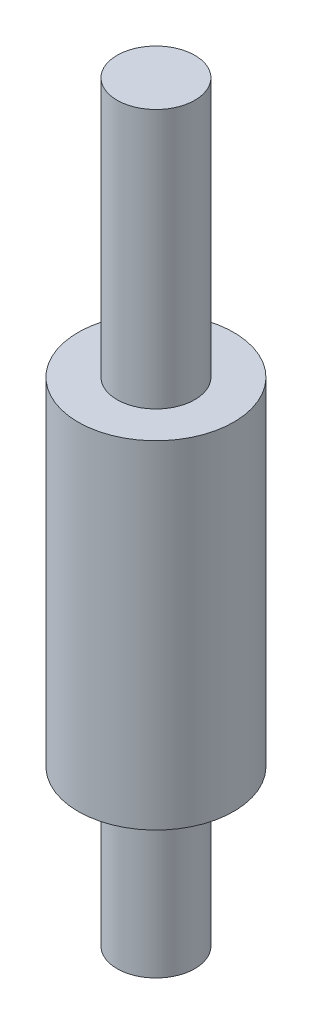
ISO-10303-21;
HEADER;
FILE_DESCRIPTION(('STEP AP214'),'2;1');
FILE_NAME('part.step','',(''),(''),'','','');
FILE_SCHEMA(('AUTOMOTIVE_DESIGN { 1 0 10303 214 1 1 1 1 }'));
ENDSEC;
DATA;
#1=APPLICATION_CONTEXT('core data for automotive mechanical design processes');
#2=APPLICATION_PROTOCOL_DEFINITION('international standard','automotive_design',2000,#1);
#3=PRODUCT_CONTEXT('',#1,'mechanical');
#4=PRODUCT('Part','Part','',(#3));
#5=PRODUCT_RELATED_PRODUCT_CATEGORY('part','',(#4));
#6=PRODUCT_DEFINITION_FORMATION('','',#4);
#7=PRODUCT_DEFINITION_CONTEXT('part definition',#1,'design');
#8=PRODUCT_DEFINITION('design','',#6,#7);
#9=PRODUCT_DEFINITION_SHAPE('','',#8);
#10=(LENGTH_UNIT() NAMED_UNIT(*) SI_UNIT(.MILLI.,.METRE.));
#11=(NAMED_UNIT(*) PLANE_ANGLE_UNIT() SI_UNIT($,.RADIAN.));
#12=(NAMED_UNIT(*) SI_UNIT($,.STERADIAN.) SOLID_ANGLE_UNIT());
#13=UNCERTAINTY_MEASURE_WITH_UNIT(LENGTH_MEASURE(1.E-05),#10,'distance_accuracy_value','');
#14=(GEOMETRIC_REPRESENTATION_CONTEXT(3) GLOBAL_UNCERTAINTY_ASSIGNED_CONTEXT((#13)) GLOBAL_UNIT_ASSIGNED_CONTEXT((#10,
#11,#12)) REPRESENTATION_CONTEXT('',''));
#15=CARTESIAN_POINT('',(0.,0.,0.));
#16=DIRECTION('',(0.,0.,1.));
#17=DIRECTION('',(1.,0.,0.));
#18=AXIS2_PLACEMENT_3D('',#15,#16,#17);
#19=CARTESIAN_POINT('',(0.,19.,0.));
#20=DIRECTION('',(0.,1.,0.));
#21=DIRECTION('',(0.,0.,1.));
#22=AXIS2_PLACEMENT_3D('',#19,#20,#21);
#23=PLANE('',#22);
#24=CARTESIAN_POINT('',(0.,19.,0.));
#25=DIRECTION('',(0.,1.,0.));
#26=DIRECTION('',(0.,0.,1.));
#27=AXIS2_PLACEMENT_3D('',#24,#25,#26);
#28=CIRCLE('',#27,3.);
#29=CARTESIAN_POINT('',(0.,19.,3.));
#30=VERTEX_POINT('',#29);
#31=EDGE_CURVE('E44',#30,#30,#28,.T.);
#32=ORIENTED_EDGE('',*,*,#31,.T.);
#33=EDGE_LOOP('',(#32));
#34=FACE_BOUND('',#33,.T.);
#35=CARTESIAN_POINT('',(0.,19.,0.));
#36=DIRECTION('',(0.,1.,0.));
#37=DIRECTION('',(0.,0.,1.));
#38=AXIS2_PLACEMENT_3D('',#35,#36,#37);
#39=CIRCLE('',#38,1.5);
#40=CARTESIAN_POINT('',(0.,19.,1.5));
#41=VERTEX_POINT('',#40);
#42=EDGE_CURVE('E52',#41,#41,#39,.T.);
#43=ORIENTED_EDGE('',*,*,#42,.F.);
#44=EDGE_LOOP('',(#43));
#45=FACE_BOUND('',#44,.T.);
#46=ADVANCED_FACE('F33',(#34,#45),#23,.T.);
#47=CARTESIAN_POINT('',(0.,6.,0.));
#48=DIRECTION('',(0.,-1.,0.));
#49=DIRECTION('',(0.,0.,-1.));
#50=AXIS2_PLACEMENT_3D('',#47,#48,#49);
#51=CYLINDRICAL_SURFACE('',#50,1.5);
#52=CARTESIAN_POINT('',(0.,6.,0.));
#53=DIRECTION('',(0.,1.,0.));
#54=DIRECTION('',(0.,0.,1.));
#55=AXIS2_PLACEMENT_3D('',#52,#53,#54);
#56=CIRCLE('',#55,1.5);
#57=CARTESIAN_POINT('',(0.,6.,1.5));
#58=VERTEX_POINT('',#57);
#59=EDGE_CURVE('E10',#58,#58,#56,.T.);
#60=ORIENTED_EDGE('',*,*,#59,.F.);
#61=EDGE_LOOP('',(#60));
#62=FACE_BOUND('',#61,.T.);
#63=CARTESIAN_POINT('',(0.,0.,0.));
#64=DIRECTION('',(0.,1.,0.));
#65=DIRECTION('',(0.,0.,1.));
#66=AXIS2_PLACEMENT_3D('',#63,#64,#65);
#67=CIRCLE('',#66,1.5);
#68=CARTESIAN_POINT('',(0.,0.,1.5));
#69=VERTEX_POINT('',#68);
#70=EDGE_CURVE('E37',#69,#69,#67,.T.);
#71=ORIENTED_EDGE('',*,*,#70,.T.);
#72=EDGE_LOOP('',(#71));
#73=FACE_BOUND('',#72,.T.);
#74=ADVANCED_FACE('F35',(#62,#73),#51,.T.);
#75=CARTESIAN_POINT('',(0.,0.,0.));
#76=DIRECTION('',(0.,1.,0.));
#77=DIRECTION('',(0.,0.,1.));
#78=AXIS2_PLACEMENT_3D('',#75,#76,#77);
#79=PLANE('',#78);
#80=ORIENTED_EDGE('',*,*,#70,.F.);
#81=EDGE_LOOP('',(#80));
#82=FACE_BOUND('',#81,.T.);
#83=ADVANCED_FACE('F73',(#82),#79,.F.);
#84=CARTESIAN_POINT('',(0.,6.,0.));
#85=DIRECTION('',(0.,1.,0.));
#86=DIRECTION('',(0.,0.,1.));
#87=AXIS2_PLACEMENT_3D('',#84,#85,#86);
#88=PLANE('',#87);
#89=CARTESIAN_POINT('',(0.,6.,0.));
#90=DIRECTION('',(0.,1.,0.));
#91=DIRECTION('',(0.,0.,1.));
#92=AXIS2_PLACEMENT_3D('',#89,#90,#91);
#93=CIRCLE('',#92,3.);
#94=CARTESIAN_POINT('',(0.,6.,3.));
#95=VERTEX_POINT('',#94);
#96=EDGE_CURVE('E46',#95,#95,#93,.T.);
#97=ORIENTED_EDGE('',*,*,#96,.F.);
#98=EDGE_LOOP('',(#97));
#99=FACE_BOUND('',#98,.T.);
#100=ORIENTED_EDGE('',*,*,#59,.T.);
#101=EDGE_LOOP('',(#100));
#102=FACE_BOUND('',#101,.T.);
#103=ADVANCED_FACE('F77',(#99,#102),#88,.F.);
#104=CARTESIAN_POINT('',(0.,19.,0.));
#105=DIRECTION('',(0.,-1.,0.));
#106=DIRECTION('',(0.,0.,-1.));
#107=AXIS2_PLACEMENT_3D('',#104,#105,#106);
#108=CYLINDRICAL_SURFACE('',#107,3.);
#109=ORIENTED_EDGE('',*,*,#31,.F.);
#110=EDGE_LOOP('',(#109));
#111=FACE_BOUND('',#110,.T.);
#112=ORIENTED_EDGE('',*,*,#96,.T.);
#113=EDGE_LOOP('',(#112));
#114=FACE_BOUND('',#113,.T.);
#115=ADVANCED_FACE('F63',(#111,#114),#108,.T.);
#116=CARTESIAN_POINT('',(0.,29.,0.));
#117=DIRECTION('',(0.,-1.,0.));
#118=DIRECTION('',(0.,0.,-1.));
#119=AXIS2_PLACEMENT_3D('',#116,#117,#118);
#120=CYLINDRICAL_SURFACE('',#119,1.5);
#121=CARTESIAN_POINT('',(0.,29.,0.));
#122=DIRECTION('',(0.,1.,0.));
#123=DIRECTION('',(0.,0.,1.));
#124=AXIS2_PLACEMENT_3D('',#121,#122,#123);
#125=CIRCLE('',#124,1.5);
#126=CARTESIAN_POINT('',(0.,29.,1.5));
#127=VERTEX_POINT('',#126);
#128=EDGE_CURVE('E49',#127,#127,#125,.T.);
#129=ORIENTED_EDGE('',*,*,#128,.F.);
#130=EDGE_LOOP('',(#129));
#131=FACE_BOUND('',#130,.T.);
#132=ORIENTED_EDGE('',*,*,#42,.T.);
#133=EDGE_LOOP('',(#132));
#134=FACE_BOUND('',#133,.T.);
#135=ADVANCED_FACE('F60',(#131,#134),#120,.T.);
#136=CARTESIAN_POINT('',(0.,29.,0.));
#137=DIRECTION('',(0.,1.,0.));
#138=DIRECTION('',(0.,0.,1.));
#139=AXIS2_PLACEMENT_3D('',#136,#137,#138);
#140=PLANE('',#139);
#141=ORIENTED_EDGE('',*,*,#128,.T.);
#142=EDGE_LOOP('',(#141));
#143=FACE_BOUND('',#142,.T.);
#144=ADVANCED_FACE('F58',(#143),#140,.T.);
#145=CLOSED_SHELL('',(#46,#74,#83,#103,#115,#135,#144));
#146=MANIFOLD_SOLID_BREP('B2',#145);
#147=ADVANCED_BREP_SHAPE_REPRESENTATION('',(#18,#146),#14);
#148=SHAPE_DEFINITION_REPRESENTATION(#9,#147);
ENDSEC;
END-ISO-10303-21;
